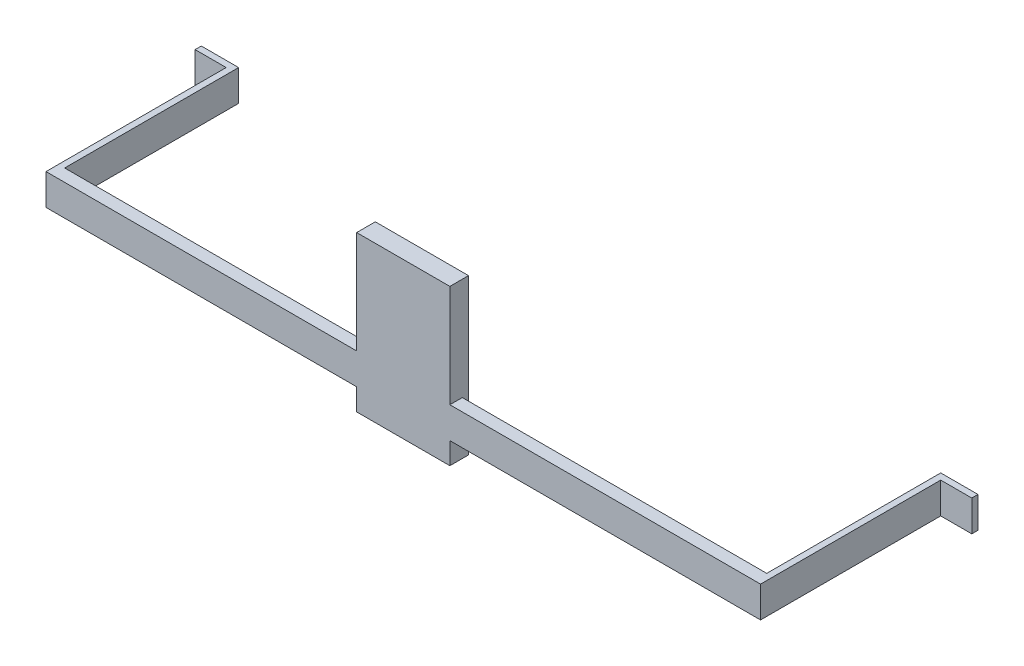
ISO-10303-21;
HEADER;
FILE_DESCRIPTION(('STEP AP214'),'2;1');
FILE_NAME('part.step','',(''),(''),'','','');
FILE_SCHEMA(('AUTOMOTIVE_DESIGN { 1 0 10303 214 1 1 1 1 }'));
ENDSEC;
DATA;
#1=APPLICATION_CONTEXT('core data for automotive mechanical design processes');
#2=APPLICATION_PROTOCOL_DEFINITION('international standard','automotive_design',2000,#1);
#3=PRODUCT_CONTEXT('',#1,'mechanical');
#4=PRODUCT('Part','Part','',(#3));
#5=PRODUCT_RELATED_PRODUCT_CATEGORY('part','',(#4));
#6=PRODUCT_DEFINITION_FORMATION('','',#4);
#7=PRODUCT_DEFINITION_CONTEXT('part definition',#1,'design');
#8=PRODUCT_DEFINITION('design','',#6,#7);
#9=PRODUCT_DEFINITION_SHAPE('','',#8);
#10=(LENGTH_UNIT() NAMED_UNIT(*) SI_UNIT(.MILLI.,.METRE.));
#11=(NAMED_UNIT(*) PLANE_ANGLE_UNIT() SI_UNIT($,.RADIAN.));
#12=(NAMED_UNIT(*) SI_UNIT($,.STERADIAN.) SOLID_ANGLE_UNIT());
#13=UNCERTAINTY_MEASURE_WITH_UNIT(LENGTH_MEASURE(1.E-05),#10,'distance_accuracy_value','');
#14=(GEOMETRIC_REPRESENTATION_CONTEXT(3) GLOBAL_UNCERTAINTY_ASSIGNED_CONTEXT((#13)) GLOBAL_UNIT_ASSIGNED_CONTEXT((#10,
#11,#12)) REPRESENTATION_CONTEXT('',''));
#15=CARTESIAN_POINT('',(0.,0.,0.));
#16=DIRECTION('',(0.,0.,1.));
#17=DIRECTION('',(1.,0.,0.));
#18=AXIS2_PLACEMENT_3D('',#15,#16,#17);
#19=CARTESIAN_POINT('',(0.,5.,0.));
#20=DIRECTION('',(0.,1.,0.));
#21=DIRECTION('',(0.,0.,1.));
#22=AXIS2_PLACEMENT_3D('',#19,#20,#21);
#23=PLANE('',#22);
#24=DIRECTION('',(-1.,0.,0.));
#25=VECTOR('',#24,1.);
#26=CARTESIAN_POINT('',(-56.5,5.,-1.));
#27=LINE('',#26,#25);
#28=CARTESIAN_POINT('',(56.5,5.,-1.));
#29=VERTEX_POINT('',#28);
#30=CARTESIAN_POINT('',(7.5,5.,-1.));
#31=VERTEX_POINT('',#30);
#32=EDGE_CURVE('E281',#29,#31,#27,.T.);
#33=ORIENTED_EDGE('',*,*,#32,.T.);
#34=DIRECTION('',(0.,0.,1.));
#35=VECTOR('',#34,1.);
#36=CARTESIAN_POINT('',(7.5,5.,0.));
#37=LINE('',#36,#35);
#38=CARTESIAN_POINT('',(7.5,5.,1.));
#39=VERTEX_POINT('',#38);
#40=EDGE_CURVE('E455',#31,#39,#37,.T.);
#41=ORIENTED_EDGE('',*,*,#40,.T.);
#42=DIRECTION('',(1.,0.,0.));
#43=VECTOR('',#42,1.);
#44=CARTESIAN_POINT('',(-57.5,5.,1.));
#45=LINE('',#44,#43);
#46=CARTESIAN_POINT('',(57.5,5.,1.));
#47=VERTEX_POINT('',#46);
#48=EDGE_CURVE('E449',#39,#47,#45,.T.);
#49=ORIENTED_EDGE('',*,*,#48,.T.);
#50=DIRECTION('',(0.,0.,-1.));
#51=VECTOR('',#50,1.);
#52=CARTESIAN_POINT('',(57.5,5.,1.));
#53=LINE('',#52,#51);
#54=CARTESIAN_POINT('',(57.5,5.,-28.));
#55=VERTEX_POINT('',#54);
#56=EDGE_CURVE('E246',#47,#55,#53,.T.);
#57=ORIENTED_EDGE('',*,*,#56,.T.);
#58=DIRECTION('',(1.,0.,0.));
#59=VECTOR('',#58,1.);
#60=CARTESIAN_POINT('',(57.5,5.,-28.));
#61=LINE('',#60,#59);
#62=CARTESIAN_POINT('',(62.5,5.,-28.));
#63=VERTEX_POINT('',#62);
#64=EDGE_CURVE('E269',#55,#63,#61,.T.);
#65=ORIENTED_EDGE('',*,*,#64,.T.);
#66=DIRECTION('',(0.,0.,-1.));
#67=VECTOR('',#66,1.);
#68=CARTESIAN_POINT('',(62.5,5.,-29.));
#69=LINE('',#68,#67);
#70=CARTESIAN_POINT('',(62.5,5.,-29.));
#71=VERTEX_POINT('',#70);
#72=EDGE_CURVE('E264',#63,#71,#69,.T.);
#73=ORIENTED_EDGE('',*,*,#72,.T.);
#74=DIRECTION('',(-1.,0.,0.));
#75=VECTOR('',#74,1.);
#76=CARTESIAN_POINT('',(56.5,5.,-29.));
#77=LINE('',#76,#75);
#78=CARTESIAN_POINT('',(56.5,5.,-29.));
#79=VERTEX_POINT('',#78);
#80=EDGE_CURVE('E268',#71,#79,#77,.T.);
#81=ORIENTED_EDGE('',*,*,#80,.T.);
#82=DIRECTION('',(0.,0.,1.));
#83=VECTOR('',#82,1.);
#84=CARTESIAN_POINT('',(56.5,5.,-1.));
#85=LINE('',#84,#83);
#86=EDGE_CURVE('E273',#79,#29,#85,.T.);
#87=ORIENTED_EDGE('',*,*,#86,.T.);
#88=EDGE_LOOP('',(#33,#41,#49,#57,#65,#73,#81,#87));
#89=FACE_BOUND('',#88,.T.);
#90=ADVANCED_FACE('F39',(#89),#23,.T.);
#91=CARTESIAN_POINT('',(-57.5,5.,1.));
#92=VERTEX_POINT('',#91);
#93=CARTESIAN_POINT('',(-7.5,5.,1.));
#94=VERTEX_POINT('',#93);
#95=EDGE_CURVE('E113',#92,#94,#45,.T.);
#96=ORIENTED_EDGE('',*,*,#95,.T.);
#97=DIRECTION('',(0.,0.,-1.));
#98=VECTOR('',#97,1.);
#99=CARTESIAN_POINT('',(-7.5,5.,0.));
#100=LINE('',#99,#98);
#101=CARTESIAN_POINT('',(-7.5,5.,-1.));
#102=VERTEX_POINT('',#101);
#103=EDGE_CURVE('E291',#94,#102,#100,.T.);
#104=ORIENTED_EDGE('',*,*,#103,.T.);
#105=CARTESIAN_POINT('',(-56.5,5.,-1.));
#106=VERTEX_POINT('',#105);
#107=EDGE_CURVE('E280',#102,#106,#27,.T.);
#108=ORIENTED_EDGE('',*,*,#107,.T.);
#109=DIRECTION('',(0.,0.,-1.));
#110=VECTOR('',#109,1.);
#111=CARTESIAN_POINT('',(-56.5,5.,-1.));
#112=LINE('',#111,#110);
#113=CARTESIAN_POINT('',(-56.5,5.,-29.));
#114=VERTEX_POINT('',#113);
#115=EDGE_CURVE('E147',#106,#114,#112,.T.);
#116=ORIENTED_EDGE('',*,*,#115,.T.);
#117=DIRECTION('',(-1.,0.,0.));
#118=VECTOR('',#117,1.);
#119=CARTESIAN_POINT('',(-56.5,5.,-29.));
#120=LINE('',#119,#118);
#121=CARTESIAN_POINT('',(-62.5,5.,-29.));
#122=VERTEX_POINT('',#121);
#123=EDGE_CURVE('E141',#114,#122,#120,.T.);
#124=ORIENTED_EDGE('',*,*,#123,.T.);
#125=DIRECTION('',(0.,0.,1.));
#126=VECTOR('',#125,1.);
#127=CARTESIAN_POINT('',(-62.5,5.,-29.));
#128=LINE('',#127,#126);
#129=CARTESIAN_POINT('',(-62.5,5.,-28.));
#130=VERTEX_POINT('',#129);
#131=EDGE_CURVE('E145',#122,#130,#128,.T.);
#132=ORIENTED_EDGE('',*,*,#131,.T.);
#133=DIRECTION('',(1.,0.,0.));
#134=VECTOR('',#133,1.);
#135=CARTESIAN_POINT('',(-57.5,5.,-28.));
#136=LINE('',#135,#134);
#137=CARTESIAN_POINT('',(-57.5,5.,-28.));
#138=VERTEX_POINT('',#137);
#139=EDGE_CURVE('E57',#130,#138,#136,.T.);
#140=ORIENTED_EDGE('',*,*,#139,.T.);
#141=DIRECTION('',(0.,0.,1.));
#142=VECTOR('',#141,1.);
#143=CARTESIAN_POINT('',(-57.5,5.,1.));
#144=LINE('',#143,#142);
#145=EDGE_CURVE('E208',#138,#92,#144,.T.);
#146=ORIENTED_EDGE('',*,*,#145,.T.);
#147=EDGE_LOOP('',(#96,#104,#108,#116,#124,#132,#140,#146));
#148=FACE_BOUND('',#147,.T.);
#149=ADVANCED_FACE('F143',(#148),#23,.T.);
#150=CARTESIAN_POINT('',(0.,0.,0.));
#151=DIRECTION('',(0.,1.,0.));
#152=DIRECTION('',(0.,0.,1.));
#153=AXIS2_PLACEMENT_3D('',#150,#151,#152);
#154=PLANE('',#153);
#155=DIRECTION('',(0.,0.,1.));
#156=VECTOR('',#155,1.);
#157=CARTESIAN_POINT('',(7.5,0.,0.));
#158=LINE('',#157,#156);
#159=CARTESIAN_POINT('',(7.5,0.,-1.));
#160=VERTEX_POINT('',#159);
#161=CARTESIAN_POINT('',(7.5,0.,1.));
#162=VERTEX_POINT('',#161);
#163=EDGE_CURVE('E478',#160,#162,#158,.T.);
#164=ORIENTED_EDGE('',*,*,#163,.F.);
#165=DIRECTION('',(-1.,0.,0.));
#166=VECTOR('',#165,1.);
#167=CARTESIAN_POINT('',(-56.5,0.,-1.));
#168=LINE('',#167,#166);
#169=CARTESIAN_POINT('',(56.5,0.,-1.));
#170=VERTEX_POINT('',#169);
#171=EDGE_CURVE('E195',#170,#160,#168,.T.);
#172=ORIENTED_EDGE('',*,*,#171,.F.);
#173=DIRECTION('',(0.,0.,1.));
#174=VECTOR('',#173,1.);
#175=CARTESIAN_POINT('',(56.5,0.,-1.));
#176=LINE('',#175,#174);
#177=CARTESIAN_POINT('',(56.5,0.,-29.));
#178=VERTEX_POINT('',#177);
#179=EDGE_CURVE('E191',#178,#170,#176,.T.);
#180=ORIENTED_EDGE('',*,*,#179,.F.);
#181=DIRECTION('',(-1.,0.,0.));
#182=VECTOR('',#181,1.);
#183=CARTESIAN_POINT('',(56.5,0.,-29.));
#184=LINE('',#183,#182);
#185=CARTESIAN_POINT('',(62.5,0.,-29.));
#186=VERTEX_POINT('',#185);
#187=EDGE_CURVE('E188',#186,#178,#184,.T.);
#188=ORIENTED_EDGE('',*,*,#187,.F.);
#189=DIRECTION('',(0.,0.,-1.));
#190=VECTOR('',#189,1.);
#191=CARTESIAN_POINT('',(62.5,0.,-29.));
#192=LINE('',#191,#190);
#193=CARTESIAN_POINT('',(62.5,0.,-28.));
#194=VERTEX_POINT('',#193);
#195=EDGE_CURVE('E185',#194,#186,#192,.T.);
#196=ORIENTED_EDGE('',*,*,#195,.F.);
#197=DIRECTION('',(1.,0.,0.));
#198=VECTOR('',#197,1.);
#199=CARTESIAN_POINT('',(57.5,0.,-28.));
#200=LINE('',#199,#198);
#201=CARTESIAN_POINT('',(57.5,0.,-28.));
#202=VERTEX_POINT('',#201);
#203=EDGE_CURVE('E182',#202,#194,#200,.T.);
#204=ORIENTED_EDGE('',*,*,#203,.F.);
#205=DIRECTION('',(0.,0.,-1.));
#206=VECTOR('',#205,1.);
#207=CARTESIAN_POINT('',(57.5,0.,1.));
#208=LINE('',#207,#206);
#209=CARTESIAN_POINT('',(57.5,0.,1.));
#210=VERTEX_POINT('',#209);
#211=EDGE_CURVE('E179',#210,#202,#208,.T.);
#212=ORIENTED_EDGE('',*,*,#211,.F.);
#213=DIRECTION('',(1.,0.,0.));
#214=VECTOR('',#213,1.);
#215=CARTESIAN_POINT('',(-57.5,0.,1.));
#216=LINE('',#215,#214);
#217=EDGE_CURVE('E173',#162,#210,#216,.T.);
#218=ORIENTED_EDGE('',*,*,#217,.F.);
#219=EDGE_LOOP('',(#164,#172,#180,#188,#196,#204,#212,#218));
#220=FACE_BOUND('',#219,.T.);
#221=ADVANCED_FACE('F252',(#220),#154,.F.);
#222=DIRECTION('',(0.,0.,-1.));
#223=VECTOR('',#222,1.);
#224=CARTESIAN_POINT('',(-7.49999999999999,0.,0.));
#225=LINE('',#224,#223);
#226=CARTESIAN_POINT('',(-7.49999999999999,0.,1.));
#227=VERTEX_POINT('',#226);
#228=CARTESIAN_POINT('',(-7.5,0.,-1.));
#229=VERTEX_POINT('',#228);
#230=EDGE_CURVE('E483',#227,#229,#225,.T.);
#231=ORIENTED_EDGE('',*,*,#230,.F.);
#232=CARTESIAN_POINT('',(-57.5,0.,1.));
#233=VERTEX_POINT('',#232);
#234=EDGE_CURVE('E175',#233,#227,#216,.T.);
#235=ORIENTED_EDGE('',*,*,#234,.F.);
#236=DIRECTION('',(0.,0.,1.));
#237=VECTOR('',#236,1.);
#238=CARTESIAN_POINT('',(-57.5,0.,1.));
#239=LINE('',#238,#237);
#240=CARTESIAN_POINT('',(-57.5,0.,-28.));
#241=VERTEX_POINT('',#240);
#242=EDGE_CURVE('E169',#241,#233,#239,.T.);
#243=ORIENTED_EDGE('',*,*,#242,.F.);
#244=DIRECTION('',(1.,0.,0.));
#245=VECTOR('',#244,1.);
#246=CARTESIAN_POINT('',(-57.5,0.,-28.));
#247=LINE('',#246,#245);
#248=CARTESIAN_POINT('',(-62.5,0.,-28.));
#249=VERTEX_POINT('',#248);
#250=EDGE_CURVE('E105',#249,#241,#247,.T.);
#251=ORIENTED_EDGE('',*,*,#250,.F.);
#252=DIRECTION('',(0.,0.,1.));
#253=VECTOR('',#252,1.);
#254=CARTESIAN_POINT('',(-62.5,0.,-29.));
#255=LINE('',#254,#253);
#256=CARTESIAN_POINT('',(-62.5,0.,-29.));
#257=VERTEX_POINT('',#256);
#258=EDGE_CURVE('E99',#257,#249,#255,.T.);
#259=ORIENTED_EDGE('',*,*,#258,.F.);
#260=DIRECTION('',(-1.,0.,0.));
#261=VECTOR('',#260,1.);
#262=CARTESIAN_POINT('',(-56.5,0.,-29.));
#263=LINE('',#262,#261);
#264=CARTESIAN_POINT('',(-56.5,0.,-29.));
#265=VERTEX_POINT('',#264);
#266=EDGE_CURVE('E156',#265,#257,#263,.T.);
#267=ORIENTED_EDGE('',*,*,#266,.F.);
#268=DIRECTION('',(0.,0.,-1.));
#269=VECTOR('',#268,1.);
#270=CARTESIAN_POINT('',(-56.5,0.,-1.));
#271=LINE('',#270,#269);
#272=CARTESIAN_POINT('',(-56.5,0.,-1.));
#273=VERTEX_POINT('',#272);
#274=EDGE_CURVE('E199',#273,#265,#271,.T.);
#275=ORIENTED_EDGE('',*,*,#274,.F.);
#276=EDGE_CURVE('E194',#229,#273,#168,.T.);
#277=ORIENTED_EDGE('',*,*,#276,.F.);
#278=EDGE_LOOP('',(#231,#235,#243,#251,#259,#267,#275,#277));
#279=FACE_BOUND('',#278,.T.);
#280=ADVANCED_FACE('F302',(#279),#154,.F.);
#281=CARTESIAN_POINT('',(-56.5,5.,-1.));
#282=DIRECTION('',(0.,0.,1.));
#283=DIRECTION('',(1.,0.,0.));
#284=AXIS2_PLACEMENT_3D('',#281,#282,#283);
#285=PLANE('',#284);
#286=DIRECTION('',(0.,-1.,0.));
#287=VECTOR('',#286,1.);
#288=CARTESIAN_POINT('',(7.5,21.5,-1.));
#289=LINE('',#288,#287);
#290=EDGE_CURVE('E409',#31,#160,#289,.T.);
#291=ORIENTED_EDGE('',*,*,#290,.F.);
#292=ORIENTED_EDGE('',*,*,#32,.F.);
#293=DIRECTION('',(0.,-1.,0.));
#294=VECTOR('',#293,1.);
#295=CARTESIAN_POINT('',(56.5,5.,-1.));
#296=LINE('',#295,#294);
#297=EDGE_CURVE('E219',#29,#170,#296,.T.);
#298=ORIENTED_EDGE('',*,*,#297,.T.);
#299=ORIENTED_EDGE('',*,*,#171,.T.);
#300=EDGE_LOOP('',(#291,#292,#298,#299));
#301=FACE_BOUND('',#300,.T.);
#302=ADVANCED_FACE('F331',(#301),#285,.F.);
#303=DIRECTION('',(0.,1.,0.));
#304=VECTOR('',#303,1.);
#305=CARTESIAN_POINT('',(-7.5,21.5,-1.));
#306=LINE('',#305,#304);
#307=EDGE_CURVE('E415',#229,#102,#306,.T.);
#308=ORIENTED_EDGE('',*,*,#307,.F.);
#309=ORIENTED_EDGE('',*,*,#276,.T.);
#310=DIRECTION('',(0.,-1.,0.));
#311=VECTOR('',#310,1.);
#312=CARTESIAN_POINT('',(-56.5,5.,-1.));
#313=LINE('',#312,#311);
#314=EDGE_CURVE('E215',#106,#273,#313,.T.);
#315=ORIENTED_EDGE('',*,*,#314,.F.);
#316=ORIENTED_EDGE('',*,*,#107,.F.);
#317=EDGE_LOOP('',(#308,#309,#315,#316));
#318=FACE_BOUND('',#317,.T.);
#319=ADVANCED_FACE('F295',(#318),#285,.F.);
#320=CARTESIAN_POINT('',(-57.5,5.,1.));
#321=DIRECTION('',(1.,0.,0.));
#322=DIRECTION('',(0.,0.,-1.));
#323=AXIS2_PLACEMENT_3D('',#320,#321,#322);
#324=PLANE('',#323);
#325=ORIENTED_EDGE('',*,*,#242,.T.);
#326=DIRECTION('',(0.,-1.,0.));
#327=VECTOR('',#326,1.);
#328=CARTESIAN_POINT('',(-57.5,5.,1.));
#329=LINE('',#328,#327);
#330=EDGE_CURVE('E11',#92,#233,#329,.T.);
#331=ORIENTED_EDGE('',*,*,#330,.F.);
#332=ORIENTED_EDGE('',*,*,#145,.F.);
#333=DIRECTION('',(0.,-1.,0.));
#334=VECTOR('',#333,1.);
#335=CARTESIAN_POINT('',(-57.5,5.,-28.));
#336=LINE('',#335,#334);
#337=EDGE_CURVE('E165',#138,#241,#336,.T.);
#338=ORIENTED_EDGE('',*,*,#337,.T.);
#339=EDGE_LOOP('',(#325,#331,#332,#338));
#340=FACE_BOUND('',#339,.T.);
#341=ADVANCED_FACE('F41',(#340),#324,.F.);
#342=CARTESIAN_POINT('',(-57.5,5.,1.));
#343=DIRECTION('',(0.,0.,-1.));
#344=DIRECTION('',(-1.,0.,0.));
#345=AXIS2_PLACEMENT_3D('',#342,#343,#344);
#346=PLANE('',#345);
#347=DIRECTION('',(0.,1.,0.));
#348=VECTOR('',#347,1.);
#349=CARTESIAN_POINT('',(-7.5,21.5,1.));
#350=LINE('',#349,#348);
#351=CARTESIAN_POINT('',(-7.5,21.5,1.));
#352=VERTEX_POINT('',#351);
#353=EDGE_CURVE('E491',#94,#352,#350,.T.);
#354=ORIENTED_EDGE('',*,*,#353,.F.);
#355=ORIENTED_EDGE('',*,*,#95,.F.);
#356=ORIENTED_EDGE('',*,*,#330,.T.);
#357=ORIENTED_EDGE('',*,*,#234,.T.);
#358=CARTESIAN_POINT('',(-7.49999999999999,-3.5,1.));
#359=VERTEX_POINT('',#358);
#360=EDGE_CURVE('E487',#359,#227,#350,.T.);
#361=ORIENTED_EDGE('',*,*,#360,.F.);
#362=DIRECTION('',(-1.,0.,0.));
#363=VECTOR('',#362,1.);
#364=CARTESIAN_POINT('',(-7.49999999999999,-3.5,1.));
#365=LINE('',#364,#363);
#366=CARTESIAN_POINT('',(7.5,-3.5,1.));
#367=VERTEX_POINT('',#366);
#368=EDGE_CURVE('E495',#367,#359,#365,.T.);
#369=ORIENTED_EDGE('',*,*,#368,.F.);
#370=DIRECTION('',(0.,-1.,0.));
#371=VECTOR('',#370,1.);
#372=CARTESIAN_POINT('',(7.5,21.5,1.));
#373=LINE('',#372,#371);
#374=EDGE_CURVE('E502',#162,#367,#373,.T.);
#375=ORIENTED_EDGE('',*,*,#374,.F.);
#376=ORIENTED_EDGE('',*,*,#217,.T.);
#377=DIRECTION('',(0.,-1.,0.));
#378=VECTOR('',#377,1.);
#379=CARTESIAN_POINT('',(57.5,5.,1.));
#380=LINE('',#379,#378);
#381=EDGE_CURVE('E49',#47,#210,#380,.T.);
#382=ORIENTED_EDGE('',*,*,#381,.F.);
#383=ORIENTED_EDGE('',*,*,#48,.F.);
#384=CARTESIAN_POINT('',(7.5,21.5,1.00000000000001));
#385=VERTEX_POINT('',#384);
#386=EDGE_CURVE('E498',#385,#39,#373,.T.);
#387=ORIENTED_EDGE('',*,*,#386,.F.);
#388=DIRECTION('',(1.,0.,0.));
#389=VECTOR('',#388,1.);
#390=CARTESIAN_POINT('',(-7.5,21.5,1.));
#391=LINE('',#390,#389);
#392=EDGE_CURVE('E506',#352,#385,#391,.T.);
#393=ORIENTED_EDGE('',*,*,#392,.F.);
#394=EDGE_LOOP('',(#354,#355,#356,#357,#361,#369,#375,#376,#382,#383,#387,#393));
#395=FACE_BOUND('',#394,.T.);
#396=ADVANCED_FACE('F519',(#395),#346,.F.);
#397=CARTESIAN_POINT('',(57.5,5.,1.));
#398=DIRECTION('',(-1.,0.,0.));
#399=DIRECTION('',(0.,0.,1.));
#400=AXIS2_PLACEMENT_3D('',#397,#398,#399);
#401=PLANE('',#400);
#402=ORIENTED_EDGE('',*,*,#211,.T.);
#403=DIRECTION('',(0.,-1.,0.));
#404=VECTOR('',#403,1.);
#405=CARTESIAN_POINT('',(57.5,5.,-28.));
#406=LINE('',#405,#404);
#407=EDGE_CURVE('E235',#55,#202,#406,.T.);
#408=ORIENTED_EDGE('',*,*,#407,.F.);
#409=ORIENTED_EDGE('',*,*,#56,.F.);
#410=ORIENTED_EDGE('',*,*,#381,.T.);
#411=EDGE_LOOP('',(#402,#408,#409,#410));
#412=FACE_BOUND('',#411,.T.);
#413=ADVANCED_FACE('F244',(#412),#401,.F.);
#414=CARTESIAN_POINT('',(57.5,5.,-28.));
#415=DIRECTION('',(0.,0.,-1.));
#416=DIRECTION('',(-1.,0.,0.));
#417=AXIS2_PLACEMENT_3D('',#414,#415,#416);
#418=PLANE('',#417);
#419=ORIENTED_EDGE('',*,*,#203,.T.);
#420=DIRECTION('',(0.,-1.,0.));
#421=VECTOR('',#420,1.);
#422=CARTESIAN_POINT('',(62.5,5.,-28.));
#423=LINE('',#422,#421);
#424=EDGE_CURVE('E231',#63,#194,#423,.T.);
#425=ORIENTED_EDGE('',*,*,#424,.F.);
#426=ORIENTED_EDGE('',*,*,#64,.F.);
#427=ORIENTED_EDGE('',*,*,#407,.T.);
#428=EDGE_LOOP('',(#419,#425,#426,#427));
#429=FACE_BOUND('',#428,.T.);
#430=ADVANCED_FACE('F258',(#429),#418,.F.);
#431=CARTESIAN_POINT('',(62.5,5.,-29.));
#432=DIRECTION('',(-1.,0.,0.));
#433=DIRECTION('',(0.,0.,1.));
#434=AXIS2_PLACEMENT_3D('',#431,#432,#433);
#435=PLANE('',#434);
#436=ORIENTED_EDGE('',*,*,#195,.T.);
#437=DIRECTION('',(0.,-1.,0.));
#438=VECTOR('',#437,1.);
#439=CARTESIAN_POINT('',(62.5,5.,-29.));
#440=LINE('',#439,#438);
#441=EDGE_CURVE('E227',#71,#186,#440,.T.);
#442=ORIENTED_EDGE('',*,*,#441,.F.);
#443=ORIENTED_EDGE('',*,*,#72,.F.);
#444=ORIENTED_EDGE('',*,*,#424,.T.);
#445=EDGE_LOOP('',(#436,#442,#443,#444));
#446=FACE_BOUND('',#445,.T.);
#447=ADVANCED_FACE('F262',(#446),#435,.F.);
#448=CARTESIAN_POINT('',(56.5,5.,-29.));
#449=DIRECTION('',(0.,0.,1.));
#450=DIRECTION('',(1.,0.,0.));
#451=AXIS2_PLACEMENT_3D('',#448,#449,#450);
#452=PLANE('',#451);
#453=ORIENTED_EDGE('',*,*,#187,.T.);
#454=DIRECTION('',(0.,-1.,0.));
#455=VECTOR('',#454,1.);
#456=CARTESIAN_POINT('',(56.5,5.,-29.));
#457=LINE('',#456,#455);
#458=EDGE_CURVE('E223',#79,#178,#457,.T.);
#459=ORIENTED_EDGE('',*,*,#458,.F.);
#460=ORIENTED_EDGE('',*,*,#80,.F.);
#461=ORIENTED_EDGE('',*,*,#441,.T.);
#462=EDGE_LOOP('',(#453,#459,#460,#461));
#463=FACE_BOUND('',#462,.T.);
#464=ADVANCED_FACE('F351',(#463),#452,.F.);
#465=CARTESIAN_POINT('',(56.5,5.,-1.));
#466=DIRECTION('',(1.,0.,0.));
#467=DIRECTION('',(0.,0.,-1.));
#468=AXIS2_PLACEMENT_3D('',#465,#466,#467);
#469=PLANE('',#468);
#470=ORIENTED_EDGE('',*,*,#179,.T.);
#471=ORIENTED_EDGE('',*,*,#297,.F.);
#472=ORIENTED_EDGE('',*,*,#86,.F.);
#473=ORIENTED_EDGE('',*,*,#458,.T.);
#474=EDGE_LOOP('',(#470,#471,#472,#473));
#475=FACE_BOUND('',#474,.T.);
#476=ADVANCED_FACE('F345',(#475),#469,.F.);
#477=DIRECTION('',(0.,1.,0.));
#478=VECTOR('',#477,1.);
#479=CARTESIAN_POINT('',(-6.5,20.5,-1.));
#480=LINE('',#479,#478);
#481=CARTESIAN_POINT('',(-6.5,-2.5,-1.));
#482=VERTEX_POINT('',#481);
#483=CARTESIAN_POINT('',(-6.5,20.5,-1.));
#484=VERTEX_POINT('',#483);
#485=EDGE_CURVE('E358',#482,#484,#480,.T.);
#486=ORIENTED_EDGE('',*,*,#485,.T.);
#487=DIRECTION('',(1.,0.,0.));
#488=VECTOR('',#487,1.);
#489=CARTESIAN_POINT('',(-6.5,20.5,-1.));
#490=LINE('',#489,#488);
#491=CARTESIAN_POINT('',(6.5,20.5,-1.));
#492=VERTEX_POINT('',#491);
#493=EDGE_CURVE('E363',#484,#492,#490,.T.);
#494=ORIENTED_EDGE('',*,*,#493,.T.);
#495=DIRECTION('',(0.,-1.,0.));
#496=VECTOR('',#495,1.);
#497=CARTESIAN_POINT('',(6.5,20.5,-1.));
#498=LINE('',#497,#496);
#499=CARTESIAN_POINT('',(6.5,-2.5,-1.));
#500=VERTEX_POINT('',#499);
#501=EDGE_CURVE('E473',#492,#500,#498,.T.);
#502=ORIENTED_EDGE('',*,*,#501,.T.);
#503=DIRECTION('',(-1.,0.,0.));
#504=VECTOR('',#503,1.);
#505=CARTESIAN_POINT('',(-6.5,-2.5,-1.));
#506=LINE('',#505,#504);
#507=EDGE_CURVE('E366',#500,#482,#506,.T.);
#508=ORIENTED_EDGE('',*,*,#507,.T.);
#509=EDGE_LOOP('',(#486,#494,#502,#508));
#510=FACE_BOUND('',#509,.T.);
#511=ADVANCED_FACE('F337',(#510),#285,.F.);
#512=CARTESIAN_POINT('',(-56.5,5.,-1.));
#513=DIRECTION('',(-1.,0.,0.));
#514=DIRECTION('',(0.,0.,1.));
#515=AXIS2_PLACEMENT_3D('',#512,#513,#514);
#516=PLANE('',#515);
#517=ORIENTED_EDGE('',*,*,#274,.T.);
#518=DIRECTION('',(0.,-1.,0.));
#519=VECTOR('',#518,1.);
#520=CARTESIAN_POINT('',(-56.5,5.,-29.));
#521=LINE('',#520,#519);
#522=EDGE_CURVE('E158',#114,#265,#521,.T.);
#523=ORIENTED_EDGE('',*,*,#522,.F.);
#524=ORIENTED_EDGE('',*,*,#115,.F.);
#525=ORIENTED_EDGE('',*,*,#314,.T.);
#526=EDGE_LOOP('',(#517,#523,#524,#525));
#527=FACE_BOUND('',#526,.T.);
#528=ADVANCED_FACE('F299',(#527),#516,.F.);
#529=CARTESIAN_POINT('',(-56.5,5.,-29.));
#530=DIRECTION('',(0.,0.,1.));
#531=DIRECTION('',(1.,0.,0.));
#532=AXIS2_PLACEMENT_3D('',#529,#530,#531);
#533=PLANE('',#532);
#534=ORIENTED_EDGE('',*,*,#266,.T.);
#535=DIRECTION('',(0.,-1.,0.));
#536=VECTOR('',#535,1.);
#537=CARTESIAN_POINT('',(-62.5,5.,-29.));
#538=LINE('',#537,#536);
#539=EDGE_CURVE('E153',#122,#257,#538,.T.);
#540=ORIENTED_EDGE('',*,*,#539,.F.);
#541=ORIENTED_EDGE('',*,*,#123,.F.);
#542=ORIENTED_EDGE('',*,*,#522,.T.);
#543=EDGE_LOOP('',(#534,#540,#541,#542));
#544=FACE_BOUND('',#543,.T.);
#545=ADVANCED_FACE('F154',(#544),#533,.F.);
#546=CARTESIAN_POINT('',(-62.5,5.,-29.));
#547=DIRECTION('',(1.,0.,0.));
#548=DIRECTION('',(0.,0.,-1.));
#549=AXIS2_PLACEMENT_3D('',#546,#547,#548);
#550=PLANE('',#549);
#551=ORIENTED_EDGE('',*,*,#258,.T.);
#552=DIRECTION('',(0.,-1.,0.));
#553=VECTOR('',#552,1.);
#554=CARTESIAN_POINT('',(-62.5,5.,-28.));
#555=LINE('',#554,#553);
#556=EDGE_CURVE('E159',#130,#249,#555,.T.);
#557=ORIENTED_EDGE('',*,*,#556,.F.);
#558=ORIENTED_EDGE('',*,*,#131,.F.);
#559=ORIENTED_EDGE('',*,*,#539,.T.);
#560=EDGE_LOOP('',(#551,#557,#558,#559));
#561=FACE_BOUND('',#560,.T.);
#562=ADVANCED_FACE('F161',(#561),#550,.F.);
#563=CARTESIAN_POINT('',(-57.5,5.,-28.));
#564=DIRECTION('',(0.,0.,-1.));
#565=DIRECTION('',(-1.,0.,0.));
#566=AXIS2_PLACEMENT_3D('',#563,#564,#565);
#567=PLANE('',#566);
#568=ORIENTED_EDGE('',*,*,#250,.T.);
#569=ORIENTED_EDGE('',*,*,#337,.F.);
#570=ORIENTED_EDGE('',*,*,#139,.F.);
#571=ORIENTED_EDGE('',*,*,#556,.T.);
#572=EDGE_LOOP('',(#568,#569,#570,#571));
#573=FACE_BOUND('',#572,.T.);
#574=ADVANCED_FACE('F307',(#573),#567,.F.);
#575=CARTESIAN_POINT('',(0.,0.,-2.));
#576=DIRECTION('',(0.,0.,-1.));
#577=DIRECTION('',(-1.,0.,0.));
#578=AXIS2_PLACEMENT_3D('',#575,#576,#577);
#579=PLANE('',#578);
#580=DIRECTION('',(1.,0.,0.));
#581=VECTOR('',#580,1.);
#582=CARTESIAN_POINT('',(-7.5,21.5,-2.));
#583=LINE('',#582,#581);
#584=CARTESIAN_POINT('',(-7.5,21.5,-2.));
#585=VERTEX_POINT('',#584);
#586=CARTESIAN_POINT('',(7.5,21.5,-2.));
#587=VERTEX_POINT('',#586);
#588=EDGE_CURVE('E410',#585,#587,#583,.T.);
#589=ORIENTED_EDGE('',*,*,#588,.T.);
#590=DIRECTION('',(0.,-1.,0.));
#591=VECTOR('',#590,1.);
#592=CARTESIAN_POINT('',(7.5,21.5,-2.));
#593=LINE('',#592,#591);
#594=CARTESIAN_POINT('',(7.5,-3.5,-2.));
#595=VERTEX_POINT('',#594);
#596=EDGE_CURVE('E414',#587,#595,#593,.T.);
#597=ORIENTED_EDGE('',*,*,#596,.T.);
#598=DIRECTION('',(-1.,0.,0.));
#599=VECTOR('',#598,1.);
#600=CARTESIAN_POINT('',(-7.5,-3.5,-2.));
#601=LINE('',#600,#599);
#602=CARTESIAN_POINT('',(-7.5,-3.5,-2.));
#603=VERTEX_POINT('',#602);
#604=EDGE_CURVE('E419',#595,#603,#601,.T.);
#605=ORIENTED_EDGE('',*,*,#604,.T.);
#606=DIRECTION('',(0.,1.,0.));
#607=VECTOR('',#606,1.);
#608=CARTESIAN_POINT('',(-7.5,21.5,-2.));
#609=LINE('',#608,#607);
#610=EDGE_CURVE('E423',#603,#585,#609,.T.);
#611=ORIENTED_EDGE('',*,*,#610,.T.);
#612=EDGE_LOOP('',(#589,#597,#605,#611));
#613=FACE_BOUND('',#612,.T.);
#614=DIRECTION('',(-1.,0.,0.));
#615=VECTOR('',#614,1.);
#616=CARTESIAN_POINT('',(-6.5,-2.5,-2.));
#617=LINE('',#616,#615);
#618=CARTESIAN_POINT('',(6.5,-2.5,-2.));
#619=VERTEX_POINT('',#618);
#620=CARTESIAN_POINT('',(-6.5,-2.5,-2.));
#621=VERTEX_POINT('',#620);
#622=EDGE_CURVE('E396',#619,#621,#617,.T.);
#623=ORIENTED_EDGE('',*,*,#622,.F.);
#624=DIRECTION('',(0.,-1.,0.));
#625=VECTOR('',#624,1.);
#626=CARTESIAN_POINT('',(6.5,20.5,-2.));
#627=LINE('',#626,#625);
#628=CARTESIAN_POINT('',(6.5,20.5,-2.));
#629=VERTEX_POINT('',#628);
#630=EDGE_CURVE('E392',#629,#619,#627,.T.);
#631=ORIENTED_EDGE('',*,*,#630,.F.);
#632=DIRECTION('',(1.,0.,0.));
#633=VECTOR('',#632,1.);
#634=CARTESIAN_POINT('',(-6.5,20.5,-2.));
#635=LINE('',#634,#633);
#636=CARTESIAN_POINT('',(-6.5,20.5,-2.));
#637=VERTEX_POINT('',#636);
#638=EDGE_CURVE('E401',#637,#629,#635,.T.);
#639=ORIENTED_EDGE('',*,*,#638,.F.);
#640=DIRECTION('',(0.,1.,0.));
#641=VECTOR('',#640,1.);
#642=CARTESIAN_POINT('',(-6.5,20.5,-2.));
#643=LINE('',#642,#641);
#644=EDGE_CURVE('E380',#621,#637,#643,.T.);
#645=ORIENTED_EDGE('',*,*,#644,.F.);
#646=EDGE_LOOP('',(#623,#631,#639,#645));
#647=FACE_BOUND('',#646,.T.);
#648=ADVANCED_FACE('F309',(#613,#647),#579,.T.);
#649=CARTESIAN_POINT('',(-7.5,21.5,-2.));
#650=DIRECTION('',(0.,-1.,0.));
#651=DIRECTION('',(1.,0.,0.));
#652=AXIS2_PLACEMENT_3D('',#649,#650,#651);
#653=PLANE('',#652);
#654=DIRECTION('',(0.,0.,1.));
#655=VECTOR('',#654,1.);
#656=CARTESIAN_POINT('',(-7.5,21.5,-2.));
#657=LINE('',#656,#655);
#658=EDGE_CURVE('E427',#585,#352,#657,.T.);
#659=ORIENTED_EDGE('',*,*,#658,.T.);
#660=ORIENTED_EDGE('',*,*,#392,.T.);
#661=DIRECTION('',(0.,0.,1.));
#662=VECTOR('',#661,1.);
#663=CARTESIAN_POINT('',(7.5,21.5,-2.));
#664=LINE('',#663,#662);
#665=EDGE_CURVE('E174',#587,#385,#664,.T.);
#666=ORIENTED_EDGE('',*,*,#665,.F.);
#667=ORIENTED_EDGE('',*,*,#588,.F.);
#668=EDGE_LOOP('',(#659,#660,#666,#667));
#669=FACE_BOUND('',#668,.T.);
#670=ADVANCED_FACE('F315',(#669),#653,.F.);
#671=CARTESIAN_POINT('',(7.5,21.5,-2.));
#672=DIRECTION('',(-1.,0.,0.));
#673=DIRECTION('',(0.,-1.,0.));
#674=AXIS2_PLACEMENT_3D('',#671,#672,#673);
#675=PLANE('',#674);
#676=ORIENTED_EDGE('',*,*,#665,.T.);
#677=ORIENTED_EDGE('',*,*,#386,.T.);
#678=ORIENTED_EDGE('',*,*,#40,.F.);
#679=ORIENTED_EDGE('',*,*,#290,.T.);
#680=ORIENTED_EDGE('',*,*,#163,.T.);
#681=ORIENTED_EDGE('',*,*,#374,.T.);
#682=DIRECTION('',(0.,0.,1.));
#683=VECTOR('',#682,1.);
#684=CARTESIAN_POINT('',(7.5,-3.5,-2.));
#685=LINE('',#684,#683);
#686=EDGE_CURVE('E440',#595,#367,#685,.T.);
#687=ORIENTED_EDGE('',*,*,#686,.F.);
#688=ORIENTED_EDGE('',*,*,#596,.F.);
#689=EDGE_LOOP('',(#676,#677,#678,#679,#680,#681,#687,#688));
#690=FACE_BOUND('',#689,.T.);
#691=ADVANCED_FACE('F564',(#690),#675,.F.);
#692=CARTESIAN_POINT('',(-7.5,-3.5,-2.));
#693=DIRECTION('',(0.,1.,0.));
#694=DIRECTION('',(-1.,0.,0.));
#695=AXIS2_PLACEMENT_3D('',#692,#693,#694);
#696=PLANE('',#695);
#697=ORIENTED_EDGE('',*,*,#686,.T.);
#698=ORIENTED_EDGE('',*,*,#368,.T.);
#699=DIRECTION('',(0.,0.,1.));
#700=VECTOR('',#699,1.);
#701=CARTESIAN_POINT('',(-7.5,-3.5,-2.));
#702=LINE('',#701,#700);
#703=EDGE_CURVE('E436',#603,#359,#702,.T.);
#704=ORIENTED_EDGE('',*,*,#703,.F.);
#705=ORIENTED_EDGE('',*,*,#604,.F.);
#706=EDGE_LOOP('',(#697,#698,#704,#705));
#707=FACE_BOUND('',#706,.T.);
#708=ADVANCED_FACE('F559',(#707),#696,.F.);
#709=CARTESIAN_POINT('',(-7.5,21.5,-2.));
#710=DIRECTION('',(1.,0.,0.));
#711=DIRECTION('',(0.,1.,0.));
#712=AXIS2_PLACEMENT_3D('',#709,#710,#711);
#713=PLANE('',#712);
#714=ORIENTED_EDGE('',*,*,#703,.T.);
#715=ORIENTED_EDGE('',*,*,#360,.T.);
#716=ORIENTED_EDGE('',*,*,#230,.T.);
#717=ORIENTED_EDGE('',*,*,#307,.T.);
#718=ORIENTED_EDGE('',*,*,#103,.F.);
#719=ORIENTED_EDGE('',*,*,#353,.T.);
#720=ORIENTED_EDGE('',*,*,#658,.F.);
#721=ORIENTED_EDGE('',*,*,#610,.F.);
#722=EDGE_LOOP('',(#714,#715,#716,#717,#718,#719,#720,#721));
#723=FACE_BOUND('',#722,.T.);
#724=ADVANCED_FACE('F553',(#723),#713,.F.);
#725=CARTESIAN_POINT('',(6.5,20.5,-2.));
#726=DIRECTION('',(-1.,0.,0.));
#727=DIRECTION('',(0.,-1.,0.));
#728=AXIS2_PLACEMENT_3D('',#725,#726,#727);
#729=PLANE('',#728);
#730=ORIENTED_EDGE('',*,*,#501,.F.);
#731=DIRECTION('',(0.,0.,1.));
#732=VECTOR('',#731,1.);
#733=CARTESIAN_POINT('',(6.5,20.5,-2.));
#734=LINE('',#733,#732);
#735=EDGE_CURVE('E386',#629,#492,#734,.T.);
#736=ORIENTED_EDGE('',*,*,#735,.F.);
#737=ORIENTED_EDGE('',*,*,#630,.T.);
#738=DIRECTION('',(0.,0.,1.));
#739=VECTOR('',#738,1.);
#740=CARTESIAN_POINT('',(6.5,-2.5,-2.));
#741=LINE('',#740,#739);
#742=EDGE_CURVE('E405',#619,#500,#741,.T.);
#743=ORIENTED_EDGE('',*,*,#742,.T.);
#744=EDGE_LOOP('',(#730,#736,#737,#743));
#745=FACE_BOUND('',#744,.T.);
#746=ADVANCED_FACE('F641',(#745),#729,.T.);
#747=CARTESIAN_POINT('',(-6.5,-2.5,-2.));
#748=DIRECTION('',(0.,1.,0.));
#749=DIRECTION('',(-1.,0.,0.));
#750=AXIS2_PLACEMENT_3D('',#747,#748,#749);
#751=PLANE('',#750);
#752=ORIENTED_EDGE('',*,*,#507,.F.);
#753=ORIENTED_EDGE('',*,*,#742,.F.);
#754=ORIENTED_EDGE('',*,*,#622,.T.);
#755=DIRECTION('',(0.,0.,1.));
#756=VECTOR('',#755,1.);
#757=CARTESIAN_POINT('',(-6.5,-2.5,-2.));
#758=LINE('',#757,#756);
#759=EDGE_CURVE('E385',#621,#482,#758,.T.);
#760=ORIENTED_EDGE('',*,*,#759,.T.);
#761=EDGE_LOOP('',(#752,#753,#754,#760));
#762=FACE_BOUND('',#761,.T.);
#763=ADVANCED_FACE('F651',(#762),#751,.T.);
#764=CARTESIAN_POINT('',(-6.5,20.5,-2.));
#765=DIRECTION('',(1.,0.,0.));
#766=DIRECTION('',(0.,1.,0.));
#767=AXIS2_PLACEMENT_3D('',#764,#765,#766);
#768=PLANE('',#767);
#769=ORIENTED_EDGE('',*,*,#485,.F.);
#770=ORIENTED_EDGE('',*,*,#759,.F.);
#771=ORIENTED_EDGE('',*,*,#644,.T.);
#772=DIRECTION('',(0.,0.,1.));
#773=VECTOR('',#772,1.);
#774=CARTESIAN_POINT('',(-6.5,20.5,-2.));
#775=LINE('',#774,#773);
#776=EDGE_CURVE('E376',#637,#484,#775,.T.);
#777=ORIENTED_EDGE('',*,*,#776,.T.);
#778=EDGE_LOOP('',(#769,#770,#771,#777));
#779=FACE_BOUND('',#778,.T.);
#780=ADVANCED_FACE('F377',(#779),#768,.T.);
#781=CARTESIAN_POINT('',(-6.5,20.5,-2.));
#782=DIRECTION('',(0.,-1.,0.));
#783=DIRECTION('',(0.,0.,-1.));
#784=AXIS2_PLACEMENT_3D('',#781,#782,#783);
#785=PLANE('',#784);
#786=ORIENTED_EDGE('',*,*,#493,.F.);
#787=ORIENTED_EDGE('',*,*,#776,.F.);
#788=ORIENTED_EDGE('',*,*,#638,.T.);
#789=ORIENTED_EDGE('',*,*,#735,.T.);
#790=EDGE_LOOP('',(#786,#787,#788,#789));
#791=FACE_BOUND('',#790,.T.);
#792=ADVANCED_FACE('F389',(#791),#785,.T.);
#793=CLOSED_SHELL('',(#90,#149,#221,#280,#302,#319,#341,#396,#413,#430,#447,#464,#476,#511,#528,
#545,#562,#574,#648,#670,#691,#708,#724,#746,#763,#780,#792));
#794=MANIFOLD_SOLID_BREP('B2',#793);
#795=ADVANCED_BREP_SHAPE_REPRESENTATION('',(#18,#794),#14);
#796=SHAPE_DEFINITION_REPRESENTATION(#9,#795);
ENDSEC;
END-ISO-10303-21;
